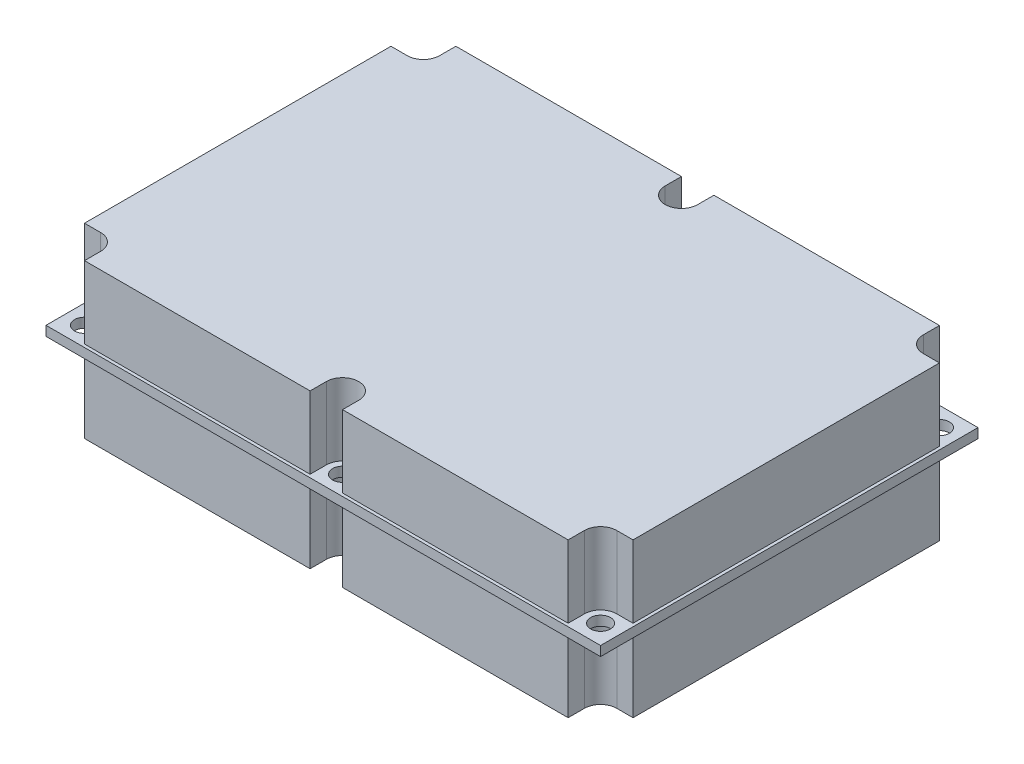
ISO-10303-21;
HEADER;
FILE_DESCRIPTION(('STEP AP214'),'2;1');
FILE_NAME('part.step','',(''),(''),'','','');
FILE_SCHEMA(('AUTOMOTIVE_DESIGN { 1 0 10303 214 1 1 1 1 }'));
ENDSEC;
DATA;
#1=APPLICATION_CONTEXT('core data for automotive mechanical design processes');
#2=APPLICATION_PROTOCOL_DEFINITION('international standard','automotive_design',2000,#1);
#3=PRODUCT_CONTEXT('',#1,'mechanical');
#4=PRODUCT('Part','Part','',(#3));
#5=PRODUCT_RELATED_PRODUCT_CATEGORY('part','',(#4));
#6=PRODUCT_DEFINITION_FORMATION('','',#4);
#7=PRODUCT_DEFINITION_CONTEXT('part definition',#1,'design');
#8=PRODUCT_DEFINITION('design','',#6,#7);
#9=PRODUCT_DEFINITION_SHAPE('','',#8);
#10=(LENGTH_UNIT() NAMED_UNIT(*) SI_UNIT(.MILLI.,.METRE.));
#11=(NAMED_UNIT(*) PLANE_ANGLE_UNIT() SI_UNIT($,.RADIAN.));
#12=(NAMED_UNIT(*) SI_UNIT($,.STERADIAN.) SOLID_ANGLE_UNIT());
#13=UNCERTAINTY_MEASURE_WITH_UNIT(LENGTH_MEASURE(1.E-05),#10,'distance_accuracy_value','');
#14=(GEOMETRIC_REPRESENTATION_CONTEXT(3) GLOBAL_UNCERTAINTY_ASSIGNED_CONTEXT((#13)) GLOBAL_UNIT_ASSIGNED_CONTEXT((#10,
#11,#12)) REPRESENTATION_CONTEXT('',''));
#15=CARTESIAN_POINT('',(0.,0.,0.));
#16=DIRECTION('',(0.,0.,1.));
#17=DIRECTION('',(1.,0.,0.));
#18=AXIS2_PLACEMENT_3D('',#15,#16,#17);
#19=CARTESIAN_POINT('',(-42.545,12.7,-27.94));
#20=DIRECTION('',(0.,-1.,0.));
#21=DIRECTION('',(0.,0.,-1.));
#22=AXIS2_PLACEMENT_3D('',#19,#20,#21);
#23=CYLINDRICAL_SURFACE('',#22,2.67499999999999);
#24=CARTESIAN_POINT('',(-42.545,-12.7,-27.94));
#25=DIRECTION('',(0.,-1.,0.));
#26=DIRECTION('',(0.,0.,1.));
#27=AXIS2_PLACEMENT_3D('',#24,#25,#26);
#28=CIRCLE('',#27,2.67499999999999);
#29=CARTESIAN_POINT('',(-39.87,-12.7,-27.94));
#30=VERTEX_POINT('',#29);
#31=CARTESIAN_POINT('',(-42.545,-12.7,-25.265));
#32=VERTEX_POINT('',#31);
#33=EDGE_CURVE('E266',#30,#32,#28,.T.);
#34=ORIENTED_EDGE('',*,*,#33,.T.);
#35=DIRECTION('',(0.,-1.,0.));
#36=VECTOR('',#35,1.);
#37=CARTESIAN_POINT('',(-42.545,12.7,-25.265));
#38=LINE('',#37,#36);
#39=CARTESIAN_POINT('',(-42.545,12.7,-25.265));
#40=VERTEX_POINT('',#39);
#41=EDGE_CURVE('E12',#40,#32,#38,.T.);
#42=ORIENTED_EDGE('',*,*,#41,.F.);
#43=CARTESIAN_POINT('',(-42.545,12.7,-27.94));
#44=DIRECTION('',(0.,-1.,0.));
#45=DIRECTION('',(0.,0.,1.));
#46=AXIS2_PLACEMENT_3D('',#43,#44,#45);
#47=CIRCLE('',#46,2.67499999999999);
#48=CARTESIAN_POINT('',(-39.87,12.7,-27.94));
#49=VERTEX_POINT('',#48);
#50=EDGE_CURVE('E324',#49,#40,#47,.T.);
#51=ORIENTED_EDGE('',*,*,#50,.F.);
#52=DIRECTION('',(0.,-1.,0.));
#53=VECTOR('',#52,1.);
#54=CARTESIAN_POINT('',(-39.87,12.7,-27.94));
#55=LINE('',#54,#53);
#56=EDGE_CURVE('E262',#49,#30,#55,.T.);
#57=ORIENTED_EDGE('',*,*,#56,.T.);
#58=EDGE_LOOP('',(#34,#42,#51,#57));
#59=FACE_BOUND('',#58,.T.);
#60=ADVANCED_FACE('F52',(#59),#23,.F.);
#61=CARTESIAN_POINT('',(-42.545,12.7,-25.265));
#62=DIRECTION('',(0.,0.,1.));
#63=DIRECTION('',(1.,0.,0.));
#64=AXIS2_PLACEMENT_3D('',#61,#62,#63);
#65=PLANE('',#64);
#66=DIRECTION('',(-1.,0.,0.));
#67=VECTOR('',#66,1.);
#68=CARTESIAN_POINT('',(-42.545,-12.7,-25.265));
#69=LINE('',#68,#67);
#70=CARTESIAN_POINT('',(-45.22,-12.7,-25.265));
#71=VERTEX_POINT('',#70);
#72=EDGE_CURVE('E270',#32,#71,#69,.T.);
#73=ORIENTED_EDGE('',*,*,#72,.T.);
#74=DIRECTION('',(0.,-1.,0.));
#75=VECTOR('',#74,1.);
#76=CARTESIAN_POINT('',(-45.22,12.7,-25.265));
#77=LINE('',#76,#75);
#78=CARTESIAN_POINT('',(-45.22,12.7,-25.265));
#79=VERTEX_POINT('',#78);
#80=EDGE_CURVE('E61',#79,#71,#77,.T.);
#81=ORIENTED_EDGE('',*,*,#80,.F.);
#82=DIRECTION('',(-1.,0.,0.));
#83=VECTOR('',#82,1.);
#84=CARTESIAN_POINT('',(-42.545,12.7,-25.265));
#85=LINE('',#84,#83);
#86=EDGE_CURVE('E173',#40,#79,#85,.T.);
#87=ORIENTED_EDGE('',*,*,#86,.F.);
#88=ORIENTED_EDGE('',*,*,#41,.T.);
#89=EDGE_LOOP('',(#73,#81,#87,#88));
#90=FACE_BOUND('',#89,.T.);
#91=ADVANCED_FACE('F484',(#90),#65,.F.);
#92=CARTESIAN_POINT('',(-45.22,12.7,-25.265));
#93=DIRECTION('',(1.,0.,0.));
#94=DIRECTION('',(0.,0.,-1.));
#95=AXIS2_PLACEMENT_3D('',#92,#93,#94);
#96=PLANE('',#95);
#97=DIRECTION('',(0.,0.,1.));
#98=VECTOR('',#97,1.);
#99=CARTESIAN_POINT('',(-45.22,-12.7,-25.265));
#100=LINE('',#99,#98);
#101=CARTESIAN_POINT('',(-45.22,-12.7,25.265));
#102=VERTEX_POINT('',#101);
#103=EDGE_CURVE('E273',#71,#102,#100,.T.);
#104=ORIENTED_EDGE('',*,*,#103,.T.);
#105=DIRECTION('',(0.,-1.,0.));
#106=VECTOR('',#105,1.);
#107=CARTESIAN_POINT('',(-45.22,12.7,25.265));
#108=LINE('',#107,#106);
#109=CARTESIAN_POINT('',(-45.22,12.7,25.265));
#110=VERTEX_POINT('',#109);
#111=EDGE_CURVE('E394',#110,#102,#108,.T.);
#112=ORIENTED_EDGE('',*,*,#111,.F.);
#113=DIRECTION('',(0.,0.,1.));
#114=VECTOR('',#113,1.);
#115=CARTESIAN_POINT('',(-45.22,12.7,-25.265));
#116=LINE('',#115,#114);
#117=EDGE_CURVE('E404',#79,#110,#116,.T.);
#118=ORIENTED_EDGE('',*,*,#117,.F.);
#119=ORIENTED_EDGE('',*,*,#80,.T.);
#120=EDGE_LOOP('',(#104,#112,#118,#119));
#121=FACE_BOUND('',#120,.T.);
#122=ADVANCED_FACE('F402',(#121),#96,.F.);
#123=CARTESIAN_POINT('',(-42.545,12.7,25.265));
#124=DIRECTION('',(0.,0.,-1.));
#125=DIRECTION('',(-1.,0.,0.));
#126=AXIS2_PLACEMENT_3D('',#123,#124,#125);
#127=PLANE('',#126);
#128=DIRECTION('',(1.,0.,0.));
#129=VECTOR('',#128,1.);
#130=CARTESIAN_POINT('',(-42.545,-12.7,25.265));
#131=LINE('',#130,#129);
#132=CARTESIAN_POINT('',(-42.545,-12.7,25.265));
#133=VERTEX_POINT('',#132);
#134=EDGE_CURVE('E276',#102,#133,#131,.T.);
#135=ORIENTED_EDGE('',*,*,#134,.T.);
#136=DIRECTION('',(0.,-1.,0.));
#137=VECTOR('',#136,1.);
#138=CARTESIAN_POINT('',(-42.545,12.7,25.265));
#139=LINE('',#138,#137);
#140=CARTESIAN_POINT('',(-42.545,12.7,25.265));
#141=VERTEX_POINT('',#140);
#142=EDGE_CURVE('E390',#141,#133,#139,.T.);
#143=ORIENTED_EDGE('',*,*,#142,.F.);
#144=DIRECTION('',(1.,0.,0.));
#145=VECTOR('',#144,1.);
#146=CARTESIAN_POINT('',(-42.545,12.7,25.265));
#147=LINE('',#146,#145);
#148=EDGE_CURVE('E422',#110,#141,#147,.T.);
#149=ORIENTED_EDGE('',*,*,#148,.F.);
#150=ORIENTED_EDGE('',*,*,#111,.T.);
#151=EDGE_LOOP('',(#135,#143,#149,#150));
#152=FACE_BOUND('',#151,.T.);
#153=ADVANCED_FACE('F413',(#152),#127,.F.);
#154=CARTESIAN_POINT('',(-42.545,12.7,27.94));
#155=DIRECTION('',(0.,-1.,0.));
#156=DIRECTION('',(0.,0.,-1.));
#157=AXIS2_PLACEMENT_3D('',#154,#155,#156);
#158=CYLINDRICAL_SURFACE('',#157,2.67500000000001);
#159=CARTESIAN_POINT('',(-42.545,-12.7,27.94));
#160=DIRECTION('',(0.,-1.,0.));
#161=DIRECTION('',(0.,0.,1.));
#162=AXIS2_PLACEMENT_3D('',#159,#160,#161);
#163=CIRCLE('',#162,2.67500000000001);
#164=CARTESIAN_POINT('',(-39.87,-12.7,27.94));
#165=VERTEX_POINT('',#164);
#166=EDGE_CURVE('E278',#133,#165,#163,.T.);
#167=ORIENTED_EDGE('',*,*,#166,.T.);
#168=DIRECTION('',(0.,-1.,0.));
#169=VECTOR('',#168,1.);
#170=CARTESIAN_POINT('',(-39.87,12.7,27.94));
#171=LINE('',#170,#169);
#172=CARTESIAN_POINT('',(-39.87,12.7,27.94));
#173=VERTEX_POINT('',#172);
#174=EDGE_CURVE('E387',#173,#165,#171,.T.);
#175=ORIENTED_EDGE('',*,*,#174,.F.);
#176=CARTESIAN_POINT('',(-42.545,12.7,27.94));
#177=DIRECTION('',(0.,-1.,0.));
#178=DIRECTION('',(0.,0.,1.));
#179=AXIS2_PLACEMENT_3D('',#176,#177,#178);
#180=CIRCLE('',#179,2.67500000000001);
#181=EDGE_CURVE('E419',#141,#173,#180,.T.);
#182=ORIENTED_EDGE('',*,*,#181,.F.);
#183=ORIENTED_EDGE('',*,*,#142,.T.);
#184=EDGE_LOOP('',(#167,#175,#182,#183));
#185=FACE_BOUND('',#184,.T.);
#186=ADVANCED_FACE('F417',(#185),#158,.F.);
#187=CARTESIAN_POINT('',(-39.87,12.7,27.94));
#188=DIRECTION('',(1.,0.,0.));
#189=DIRECTION('',(0.,0.,-1.));
#190=AXIS2_PLACEMENT_3D('',#187,#188,#189);
#191=PLANE('',#190);
#192=DIRECTION('',(0.,0.,1.));
#193=VECTOR('',#192,1.);
#194=CARTESIAN_POINT('',(-39.87,-12.7,27.94));
#195=LINE('',#194,#193);
#196=CARTESIAN_POINT('',(-39.87,-12.7,30.615));
#197=VERTEX_POINT('',#196);
#198=EDGE_CURVE('E280',#165,#197,#195,.T.);
#199=ORIENTED_EDGE('',*,*,#198,.T.);
#200=DIRECTION('',(0.,-1.,0.));
#201=VECTOR('',#200,1.);
#202=CARTESIAN_POINT('',(-39.87,12.7,30.615));
#203=LINE('',#202,#201);
#204=CARTESIAN_POINT('',(-39.87,12.7,30.615));
#205=VERTEX_POINT('',#204);
#206=EDGE_CURVE('E383',#205,#197,#203,.T.);
#207=ORIENTED_EDGE('',*,*,#206,.F.);
#208=DIRECTION('',(0.,0.,1.));
#209=VECTOR('',#208,1.);
#210=CARTESIAN_POINT('',(-39.87,12.7,27.94));
#211=LINE('',#210,#209);
#212=EDGE_CURVE('E421',#173,#205,#211,.T.);
#213=ORIENTED_EDGE('',*,*,#212,.F.);
#214=ORIENTED_EDGE('',*,*,#174,.T.);
#215=EDGE_LOOP('',(#199,#207,#213,#214));
#216=FACE_BOUND('',#215,.T.);
#217=ADVANCED_FACE('F497',(#216),#191,.F.);
#218=CARTESIAN_POINT('',(-39.87,12.7,30.615));
#219=DIRECTION('',(0.,0.,-1.));
#220=DIRECTION('',(-1.,0.,0.));
#221=AXIS2_PLACEMENT_3D('',#218,#219,#220);
#222=PLANE('',#221);
#223=DIRECTION('',(1.,0.,0.));
#224=VECTOR('',#223,1.);
#225=CARTESIAN_POINT('',(-39.87,-12.7,30.615));
#226=LINE('',#225,#224);
#227=CARTESIAN_POINT('',(-2.675,-12.7,30.615));
#228=VERTEX_POINT('',#227);
#229=EDGE_CURVE('E282',#197,#228,#226,.T.);
#230=ORIENTED_EDGE('',*,*,#229,.T.);
#231=DIRECTION('',(0.,-1.,0.));
#232=VECTOR('',#231,1.);
#233=CARTESIAN_POINT('',(-2.675,12.7,30.615));
#234=LINE('',#233,#232);
#235=CARTESIAN_POINT('',(-2.675,12.7,30.615));
#236=VERTEX_POINT('',#235);
#237=EDGE_CURVE('E379',#236,#228,#234,.T.);
#238=ORIENTED_EDGE('',*,*,#237,.F.);
#239=DIRECTION('',(1.,0.,0.));
#240=VECTOR('',#239,1.);
#241=CARTESIAN_POINT('',(-39.87,12.7,30.615));
#242=LINE('',#241,#240);
#243=EDGE_CURVE('E424',#205,#236,#242,.T.);
#244=ORIENTED_EDGE('',*,*,#243,.F.);
#245=ORIENTED_EDGE('',*,*,#206,.T.);
#246=EDGE_LOOP('',(#230,#238,#244,#245));
#247=FACE_BOUND('',#246,.T.);
#248=ADVANCED_FACE('F500',(#247),#222,.F.);
#249=CARTESIAN_POINT('',(-2.67499999999998,12.7,27.94));
#250=DIRECTION('',(-1.,0.,0.));
#251=DIRECTION('',(0.,0.,1.));
#252=AXIS2_PLACEMENT_3D('',#249,#250,#251);
#253=PLANE('',#252);
#254=DIRECTION('',(0.,0.,-1.));
#255=VECTOR('',#254,1.);
#256=CARTESIAN_POINT('',(-2.67499999999998,-12.7,27.94));
#257=LINE('',#256,#255);
#258=CARTESIAN_POINT('',(-2.67499999999998,-12.7,27.94));
#259=VERTEX_POINT('',#258);
#260=EDGE_CURVE('E285',#228,#259,#257,.T.);
#261=ORIENTED_EDGE('',*,*,#260,.T.);
#262=DIRECTION('',(0.,-1.,0.));
#263=VECTOR('',#262,1.);
#264=CARTESIAN_POINT('',(-2.67499999999998,12.7,27.94));
#265=LINE('',#264,#263);
#266=CARTESIAN_POINT('',(-2.67499999999998,12.7,27.94));
#267=VERTEX_POINT('',#266);
#268=EDGE_CURVE('E375',#267,#259,#265,.T.);
#269=ORIENTED_EDGE('',*,*,#268,.F.);
#270=DIRECTION('',(0.,0.,-1.));
#271=VECTOR('',#270,1.);
#272=CARTESIAN_POINT('',(-2.67499999999998,12.7,27.94));
#273=LINE('',#272,#271);
#274=EDGE_CURVE('E430',#236,#267,#273,.T.);
#275=ORIENTED_EDGE('',*,*,#274,.F.);
#276=ORIENTED_EDGE('',*,*,#237,.T.);
#277=EDGE_LOOP('',(#261,#269,#275,#276));
#278=FACE_BOUND('',#277,.T.);
#279=ADVANCED_FACE('F504',(#278),#253,.F.);
#280=CARTESIAN_POINT('',(0.,12.7,27.94));
#281=DIRECTION('',(0.,-1.,0.));
#282=DIRECTION('',(0.,0.,-1.));
#283=AXIS2_PLACEMENT_3D('',#280,#281,#282);
#284=CYLINDRICAL_SURFACE('',#283,2.67499999999999);
#285=CARTESIAN_POINT('',(0.,-12.7,27.94));
#286=DIRECTION('',(0.,-1.,0.));
#287=DIRECTION('',(0.,0.,1.));
#288=AXIS2_PLACEMENT_3D('',#285,#286,#287);
#289=CIRCLE('',#288,2.67499999999999);
#290=CARTESIAN_POINT('',(2.675,-12.7,27.94));
#291=VERTEX_POINT('',#290);
#292=EDGE_CURVE('E287',#259,#291,#289,.T.);
#293=ORIENTED_EDGE('',*,*,#292,.T.);
#294=DIRECTION('',(0.,-1.,0.));
#295=VECTOR('',#294,1.);
#296=CARTESIAN_POINT('',(2.675,12.7,27.94));
#297=LINE('',#296,#295);
#298=CARTESIAN_POINT('',(2.675,12.7,27.94));
#299=VERTEX_POINT('',#298);
#300=EDGE_CURVE('E372',#299,#291,#297,.T.);
#301=ORIENTED_EDGE('',*,*,#300,.F.);
#302=CARTESIAN_POINT('',(0.,12.7,27.94));
#303=DIRECTION('',(0.,-1.,0.));
#304=DIRECTION('',(0.,0.,1.));
#305=AXIS2_PLACEMENT_3D('',#302,#303,#304);
#306=CIRCLE('',#305,2.67499999999999);
#307=EDGE_CURVE('E432',#267,#299,#306,.T.);
#308=ORIENTED_EDGE('',*,*,#307,.F.);
#309=ORIENTED_EDGE('',*,*,#268,.T.);
#310=EDGE_LOOP('',(#293,#301,#308,#309));
#311=FACE_BOUND('',#310,.T.);
#312=ADVANCED_FACE('F508',(#311),#284,.F.);
#313=CARTESIAN_POINT('',(2.675,12.7,27.94));
#314=DIRECTION('',(1.,0.,0.));
#315=DIRECTION('',(0.,0.,-1.));
#316=AXIS2_PLACEMENT_3D('',#313,#314,#315);
#317=PLANE('',#316);
#318=DIRECTION('',(0.,0.,1.));
#319=VECTOR('',#318,1.);
#320=CARTESIAN_POINT('',(2.675,-12.7,27.94));
#321=LINE('',#320,#319);
#322=CARTESIAN_POINT('',(2.675,-12.7,30.615));
#323=VERTEX_POINT('',#322);
#324=EDGE_CURVE('E290',#291,#323,#321,.T.);
#325=ORIENTED_EDGE('',*,*,#324,.T.);
#326=DIRECTION('',(0.,-1.,0.));
#327=VECTOR('',#326,1.);
#328=CARTESIAN_POINT('',(2.675,12.7,30.615));
#329=LINE('',#328,#327);
#330=CARTESIAN_POINT('',(2.675,12.7,30.615));
#331=VERTEX_POINT('',#330);
#332=EDGE_CURVE('E368',#331,#323,#329,.T.);
#333=ORIENTED_EDGE('',*,*,#332,.F.);
#334=DIRECTION('',(0.,0.,1.));
#335=VECTOR('',#334,1.);
#336=CARTESIAN_POINT('',(2.675,12.7,27.94));
#337=LINE('',#336,#335);
#338=EDGE_CURVE('E434',#299,#331,#337,.T.);
#339=ORIENTED_EDGE('',*,*,#338,.F.);
#340=ORIENTED_EDGE('',*,*,#300,.T.);
#341=EDGE_LOOP('',(#325,#333,#339,#340));
#342=FACE_BOUND('',#341,.T.);
#343=ADVANCED_FACE('F512',(#342),#317,.F.);
#344=CARTESIAN_POINT('',(2.675,12.7,30.615));
#345=DIRECTION('',(0.,0.,-1.));
#346=DIRECTION('',(-1.,0.,0.));
#347=AXIS2_PLACEMENT_3D('',#344,#345,#346);
#348=PLANE('',#347);
#349=DIRECTION('',(1.,0.,0.));
#350=VECTOR('',#349,1.);
#351=CARTESIAN_POINT('',(2.675,-12.7,30.615));
#352=LINE('',#351,#350);
#353=CARTESIAN_POINT('',(39.87,-12.7,30.615));
#354=VERTEX_POINT('',#353);
#355=EDGE_CURVE('E292',#323,#354,#352,.T.);
#356=ORIENTED_EDGE('',*,*,#355,.T.);
#357=DIRECTION('',(0.,-1.,0.));
#358=VECTOR('',#357,1.);
#359=CARTESIAN_POINT('',(39.87,12.7,30.615));
#360=LINE('',#359,#358);
#361=CARTESIAN_POINT('',(39.87,12.7,30.615));
#362=VERTEX_POINT('',#361);
#363=EDGE_CURVE('E364',#362,#354,#360,.T.);
#364=ORIENTED_EDGE('',*,*,#363,.F.);
#365=DIRECTION('',(1.,0.,0.));
#366=VECTOR('',#365,1.);
#367=CARTESIAN_POINT('',(2.675,12.7,30.615));
#368=LINE('',#367,#366);
#369=EDGE_CURVE('E436',#331,#362,#368,.T.);
#370=ORIENTED_EDGE('',*,*,#369,.F.);
#371=ORIENTED_EDGE('',*,*,#332,.T.);
#372=EDGE_LOOP('',(#356,#364,#370,#371));
#373=FACE_BOUND('',#372,.T.);
#374=ADVANCED_FACE('F516',(#373),#348,.F.);
#375=CARTESIAN_POINT('',(39.87,12.7,27.94));
#376=DIRECTION('',(-1.,0.,0.));
#377=DIRECTION('',(0.,0.,1.));
#378=AXIS2_PLACEMENT_3D('',#375,#376,#377);
#379=PLANE('',#378);
#380=DIRECTION('',(0.,0.,-1.));
#381=VECTOR('',#380,1.);
#382=CARTESIAN_POINT('',(39.87,-12.7,27.94));
#383=LINE('',#382,#381);
#384=CARTESIAN_POINT('',(39.87,-12.7,27.94));
#385=VERTEX_POINT('',#384);
#386=EDGE_CURVE('E294',#354,#385,#383,.T.);
#387=ORIENTED_EDGE('',*,*,#386,.T.);
#388=DIRECTION('',(0.,-1.,0.));
#389=VECTOR('',#388,1.);
#390=CARTESIAN_POINT('',(39.87,12.7,27.94));
#391=LINE('',#390,#389);
#392=CARTESIAN_POINT('',(39.87,12.7,27.94));
#393=VERTEX_POINT('',#392);
#394=EDGE_CURVE('E360',#393,#385,#391,.T.);
#395=ORIENTED_EDGE('',*,*,#394,.F.);
#396=DIRECTION('',(0.,0.,-1.));
#397=VECTOR('',#396,1.);
#398=CARTESIAN_POINT('',(39.87,12.7,27.94));
#399=LINE('',#398,#397);
#400=EDGE_CURVE('E439',#362,#393,#399,.T.);
#401=ORIENTED_EDGE('',*,*,#400,.F.);
#402=ORIENTED_EDGE('',*,*,#363,.T.);
#403=EDGE_LOOP('',(#387,#395,#401,#402));
#404=FACE_BOUND('',#403,.T.);
#405=ADVANCED_FACE('F520',(#404),#379,.F.);
#406=CARTESIAN_POINT('',(42.545,12.7,27.94));
#407=DIRECTION('',(0.,-1.,0.));
#408=DIRECTION('',(0.,0.,-1.));
#409=AXIS2_PLACEMENT_3D('',#406,#407,#408);
#410=CYLINDRICAL_SURFACE('',#409,2.67499999999998);
#411=CARTESIAN_POINT('',(42.545,-12.7,27.94));
#412=DIRECTION('',(0.,-1.,0.));
#413=DIRECTION('',(0.,0.,1.));
#414=AXIS2_PLACEMENT_3D('',#411,#412,#413);
#415=CIRCLE('',#414,2.67499999999998);
#416=CARTESIAN_POINT('',(42.545,-12.7,25.265));
#417=VERTEX_POINT('',#416);
#418=EDGE_CURVE('E296',#385,#417,#415,.T.);
#419=ORIENTED_EDGE('',*,*,#418,.T.);
#420=DIRECTION('',(0.,-1.,0.));
#421=VECTOR('',#420,1.);
#422=CARTESIAN_POINT('',(42.545,12.7,25.265));
#423=LINE('',#422,#421);
#424=CARTESIAN_POINT('',(42.545,12.7,25.265));
#425=VERTEX_POINT('',#424);
#426=EDGE_CURVE('E356',#425,#417,#423,.T.);
#427=ORIENTED_EDGE('',*,*,#426,.F.);
#428=CARTESIAN_POINT('',(42.545,12.7,27.94));
#429=DIRECTION('',(0.,-1.,0.));
#430=DIRECTION('',(0.,0.,1.));
#431=AXIS2_PLACEMENT_3D('',#428,#429,#430);
#432=CIRCLE('',#431,2.67499999999998);
#433=EDGE_CURVE('E442',#393,#425,#432,.T.);
#434=ORIENTED_EDGE('',*,*,#433,.F.);
#435=ORIENTED_EDGE('',*,*,#394,.T.);
#436=EDGE_LOOP('',(#419,#427,#434,#435));
#437=FACE_BOUND('',#436,.T.);
#438=ADVANCED_FACE('F524',(#437),#410,.F.);
#439=CARTESIAN_POINT('',(42.545,12.7,25.265));
#440=DIRECTION('',(0.,0.,-1.));
#441=DIRECTION('',(-1.,0.,0.));
#442=AXIS2_PLACEMENT_3D('',#439,#440,#441);
#443=PLANE('',#442);
#444=DIRECTION('',(1.,0.,0.));
#445=VECTOR('',#444,1.);
#446=CARTESIAN_POINT('',(42.545,-12.7,25.265));
#447=LINE('',#446,#445);
#448=CARTESIAN_POINT('',(45.22,-12.7,25.265));
#449=VERTEX_POINT('',#448);
#450=EDGE_CURVE('E298',#417,#449,#447,.T.);
#451=ORIENTED_EDGE('',*,*,#450,.T.);
#452=DIRECTION('',(0.,-1.,0.));
#453=VECTOR('',#452,1.);
#454=CARTESIAN_POINT('',(45.22,12.7,25.265));
#455=LINE('',#454,#453);
#456=CARTESIAN_POINT('',(45.22,12.7,25.265));
#457=VERTEX_POINT('',#456);
#458=EDGE_CURVE('E352',#457,#449,#455,.T.);
#459=ORIENTED_EDGE('',*,*,#458,.F.);
#460=DIRECTION('',(1.,0.,0.));
#461=VECTOR('',#460,1.);
#462=CARTESIAN_POINT('',(42.545,12.7,25.265));
#463=LINE('',#462,#461);
#464=EDGE_CURVE('E445',#425,#457,#463,.T.);
#465=ORIENTED_EDGE('',*,*,#464,.F.);
#466=ORIENTED_EDGE('',*,*,#426,.T.);
#467=EDGE_LOOP('',(#451,#459,#465,#466));
#468=FACE_BOUND('',#467,.T.);
#469=ADVANCED_FACE('F528',(#468),#443,.F.);
#470=CARTESIAN_POINT('',(45.22,12.7,25.265));
#471=DIRECTION('',(-1.,0.,0.));
#472=DIRECTION('',(0.,0.,1.));
#473=AXIS2_PLACEMENT_3D('',#470,#471,#472);
#474=PLANE('',#473);
#475=DIRECTION('',(0.,0.,-1.));
#476=VECTOR('',#475,1.);
#477=CARTESIAN_POINT('',(45.22,-12.7,25.265));
#478=LINE('',#477,#476);
#479=CARTESIAN_POINT('',(45.22,-12.7,-25.265));
#480=VERTEX_POINT('',#479);
#481=EDGE_CURVE('E300',#449,#480,#478,.T.);
#482=ORIENTED_EDGE('',*,*,#481,.T.);
#483=DIRECTION('',(0.,-1.,0.));
#484=VECTOR('',#483,1.);
#485=CARTESIAN_POINT('',(45.22,12.7,-25.265));
#486=LINE('',#485,#484);
#487=CARTESIAN_POINT('',(45.22,12.7,-25.265));
#488=VERTEX_POINT('',#487);
#489=EDGE_CURVE('E348',#488,#480,#486,.T.);
#490=ORIENTED_EDGE('',*,*,#489,.F.);
#491=DIRECTION('',(0.,0.,-1.));
#492=VECTOR('',#491,1.);
#493=CARTESIAN_POINT('',(45.22,12.7,25.265));
#494=LINE('',#493,#492);
#495=EDGE_CURVE('E448',#457,#488,#494,.T.);
#496=ORIENTED_EDGE('',*,*,#495,.F.);
#497=ORIENTED_EDGE('',*,*,#458,.T.);
#498=EDGE_LOOP('',(#482,#490,#496,#497));
#499=FACE_BOUND('',#498,.T.);
#500=ADVANCED_FACE('F532',(#499),#474,.F.);
#501=CARTESIAN_POINT('',(42.545,12.7,-25.265));
#502=DIRECTION('',(0.,0.,1.));
#503=DIRECTION('',(1.,0.,0.));
#504=AXIS2_PLACEMENT_3D('',#501,#502,#503);
#505=PLANE('',#504);
#506=DIRECTION('',(-1.,0.,0.));
#507=VECTOR('',#506,1.);
#508=CARTESIAN_POINT('',(42.545,-12.7,-25.265));
#509=LINE('',#508,#507);
#510=CARTESIAN_POINT('',(42.545,-12.7,-25.265));
#511=VERTEX_POINT('',#510);
#512=EDGE_CURVE('E303',#480,#511,#509,.T.);
#513=ORIENTED_EDGE('',*,*,#512,.T.);
#514=DIRECTION('',(0.,-1.,0.));
#515=VECTOR('',#514,1.);
#516=CARTESIAN_POINT('',(42.545,12.7,-25.265));
#517=LINE('',#516,#515);
#518=CARTESIAN_POINT('',(42.545,12.7,-25.265));
#519=VERTEX_POINT('',#518);
#520=EDGE_CURVE('E344',#519,#511,#517,.T.);
#521=ORIENTED_EDGE('',*,*,#520,.F.);
#522=DIRECTION('',(-1.,0.,0.));
#523=VECTOR('',#522,1.);
#524=CARTESIAN_POINT('',(42.545,12.7,-25.265));
#525=LINE('',#524,#523);
#526=EDGE_CURVE('E451',#488,#519,#525,.T.);
#527=ORIENTED_EDGE('',*,*,#526,.F.);
#528=ORIENTED_EDGE('',*,*,#489,.T.);
#529=EDGE_LOOP('',(#513,#521,#527,#528));
#530=FACE_BOUND('',#529,.T.);
#531=ADVANCED_FACE('F536',(#530),#505,.F.);
#532=CARTESIAN_POINT('',(42.545,12.7,-27.94));
#533=DIRECTION('',(0.,-1.,0.));
#534=DIRECTION('',(0.,0.,-1.));
#535=AXIS2_PLACEMENT_3D('',#532,#533,#534);
#536=CYLINDRICAL_SURFACE('',#535,2.675);
#537=CARTESIAN_POINT('',(42.545,-12.7,-27.94));
#538=DIRECTION('',(0.,-1.,0.));
#539=DIRECTION('',(0.,0.,1.));
#540=AXIS2_PLACEMENT_3D('',#537,#538,#539);
#541=CIRCLE('',#540,2.675);
#542=CARTESIAN_POINT('',(39.87,-12.7,-27.94));
#543=VERTEX_POINT('',#542);
#544=EDGE_CURVE('E306',#511,#543,#541,.T.);
#545=ORIENTED_EDGE('',*,*,#544,.T.);
#546=DIRECTION('',(0.,-1.,0.));
#547=VECTOR('',#546,1.);
#548=CARTESIAN_POINT('',(39.87,12.7,-27.94));
#549=LINE('',#548,#547);
#550=CARTESIAN_POINT('',(39.87,12.7,-27.94));
#551=VERTEX_POINT('',#550);
#552=EDGE_CURVE('E340',#551,#543,#549,.T.);
#553=ORIENTED_EDGE('',*,*,#552,.F.);
#554=CARTESIAN_POINT('',(42.545,12.7,-27.94));
#555=DIRECTION('',(0.,-1.,0.));
#556=DIRECTION('',(0.,0.,1.));
#557=AXIS2_PLACEMENT_3D('',#554,#555,#556);
#558=CIRCLE('',#557,2.675);
#559=EDGE_CURVE('E453',#519,#551,#558,.T.);
#560=ORIENTED_EDGE('',*,*,#559,.F.);
#561=ORIENTED_EDGE('',*,*,#520,.T.);
#562=EDGE_LOOP('',(#545,#553,#560,#561));
#563=FACE_BOUND('',#562,.T.);
#564=ADVANCED_FACE('F540',(#563),#536,.F.);
#565=CARTESIAN_POINT('',(39.87,12.7,-27.94));
#566=DIRECTION('',(-1.,0.,0.));
#567=DIRECTION('',(0.,0.,1.));
#568=AXIS2_PLACEMENT_3D('',#565,#566,#567);
#569=PLANE('',#568);
#570=DIRECTION('',(0.,0.,-1.));
#571=VECTOR('',#570,1.);
#572=CARTESIAN_POINT('',(39.87,-12.7,-27.94));
#573=LINE('',#572,#571);
#574=CARTESIAN_POINT('',(39.87,-12.7,-30.615));
#575=VERTEX_POINT('',#574);
#576=EDGE_CURVE('E309',#543,#575,#573,.T.);
#577=ORIENTED_EDGE('',*,*,#576,.T.);
#578=DIRECTION('',(0.,-1.,0.));
#579=VECTOR('',#578,1.);
#580=CARTESIAN_POINT('',(39.87,12.7,-30.615));
#581=LINE('',#580,#579);
#582=CARTESIAN_POINT('',(39.87,12.7,-30.615));
#583=VERTEX_POINT('',#582);
#584=EDGE_CURVE('E336',#583,#575,#581,.T.);
#585=ORIENTED_EDGE('',*,*,#584,.F.);
#586=DIRECTION('',(0.,0.,-1.));
#587=VECTOR('',#586,1.);
#588=CARTESIAN_POINT('',(39.87,12.7,-27.94));
#589=LINE('',#588,#587);
#590=EDGE_CURVE('E455',#551,#583,#589,.T.);
#591=ORIENTED_EDGE('',*,*,#590,.F.);
#592=ORIENTED_EDGE('',*,*,#552,.T.);
#593=EDGE_LOOP('',(#577,#585,#591,#592));
#594=FACE_BOUND('',#593,.T.);
#595=ADVANCED_FACE('F544',(#594),#569,.F.);
#596=CARTESIAN_POINT('',(39.87,12.7,-30.615));
#597=DIRECTION('',(0.,0.,1.));
#598=DIRECTION('',(1.,0.,0.));
#599=AXIS2_PLACEMENT_3D('',#596,#597,#598);
#600=PLANE('',#599);
#601=DIRECTION('',(-1.,0.,0.));
#602=VECTOR('',#601,1.);
#603=CARTESIAN_POINT('',(39.87,-12.7,-30.615));
#604=LINE('',#603,#602);
#605=CARTESIAN_POINT('',(2.675,-12.7,-30.615));
#606=VERTEX_POINT('',#605);
#607=EDGE_CURVE('E312',#575,#606,#604,.T.);
#608=ORIENTED_EDGE('',*,*,#607,.T.);
#609=DIRECTION('',(0.,-1.,0.));
#610=VECTOR('',#609,1.);
#611=CARTESIAN_POINT('',(2.675,12.7,-30.615));
#612=LINE('',#611,#610);
#613=CARTESIAN_POINT('',(2.675,12.7,-30.615));
#614=VERTEX_POINT('',#613);
#615=EDGE_CURVE('E333',#614,#606,#612,.T.);
#616=ORIENTED_EDGE('',*,*,#615,.F.);
#617=DIRECTION('',(-1.,0.,0.));
#618=VECTOR('',#617,1.);
#619=CARTESIAN_POINT('',(39.87,12.7,-30.615));
#620=LINE('',#619,#618);
#621=EDGE_CURVE('E457',#583,#614,#620,.T.);
#622=ORIENTED_EDGE('',*,*,#621,.F.);
#623=ORIENTED_EDGE('',*,*,#584,.T.);
#624=EDGE_LOOP('',(#608,#616,#622,#623));
#625=FACE_BOUND('',#624,.T.);
#626=ADVANCED_FACE('F548',(#625),#600,.F.);
#627=CARTESIAN_POINT('',(2.675,12.7,-27.94));
#628=DIRECTION('',(1.,0.,0.));
#629=DIRECTION('',(0.,0.,-1.));
#630=AXIS2_PLACEMENT_3D('',#627,#628,#629);
#631=PLANE('',#630);
#632=DIRECTION('',(0.,0.,1.));
#633=VECTOR('',#632,1.);
#634=CARTESIAN_POINT('',(2.675,-12.7,-27.94));
#635=LINE('',#634,#633);
#636=CARTESIAN_POINT('',(2.675,-12.7,-27.94));
#637=VERTEX_POINT('',#636);
#638=EDGE_CURVE('E315',#606,#637,#635,.T.);
#639=ORIENTED_EDGE('',*,*,#638,.T.);
#640=DIRECTION('',(0.,-1.,0.));
#641=VECTOR('',#640,1.);
#642=CARTESIAN_POINT('',(2.675,12.7,-27.94));
#643=LINE('',#642,#641);
#644=CARTESIAN_POINT('',(2.675,12.7,-27.94));
#645=VERTEX_POINT('',#644);
#646=EDGE_CURVE('E330',#645,#637,#643,.T.);
#647=ORIENTED_EDGE('',*,*,#646,.F.);
#648=DIRECTION('',(0.,0.,1.));
#649=VECTOR('',#648,1.);
#650=CARTESIAN_POINT('',(2.675,12.7,-27.94));
#651=LINE('',#650,#649);
#652=EDGE_CURVE('E459',#614,#645,#651,.T.);
#653=ORIENTED_EDGE('',*,*,#652,.F.);
#654=ORIENTED_EDGE('',*,*,#615,.T.);
#655=EDGE_LOOP('',(#639,#647,#653,#654));
#656=FACE_BOUND('',#655,.T.);
#657=ADVANCED_FACE('F465',(#656),#631,.F.);
#658=CARTESIAN_POINT('',(0.,12.7,-27.94));
#659=DIRECTION('',(0.,-1.,0.));
#660=DIRECTION('',(0.,0.,-1.));
#661=AXIS2_PLACEMENT_3D('',#658,#659,#660);
#662=CYLINDRICAL_SURFACE('',#661,2.675);
#663=CARTESIAN_POINT('',(0.,-12.7,-27.94));
#664=DIRECTION('',(0.,-1.,0.));
#665=DIRECTION('',(0.,0.,1.));
#666=AXIS2_PLACEMENT_3D('',#663,#664,#665);
#667=CIRCLE('',#666,2.675);
#668=CARTESIAN_POINT('',(-2.675,-12.7,-27.94));
#669=VERTEX_POINT('',#668);
#670=EDGE_CURVE('E317',#637,#669,#667,.T.);
#671=ORIENTED_EDGE('',*,*,#670,.T.);
#672=DIRECTION('',(0.,-1.,0.));
#673=VECTOR('',#672,1.);
#674=CARTESIAN_POINT('',(-2.675,12.7,-27.94));
#675=LINE('',#674,#673);
#676=CARTESIAN_POINT('',(-2.675,12.7,-27.94));
#677=VERTEX_POINT('',#676);
#678=EDGE_CURVE('E254',#677,#669,#675,.T.);
#679=ORIENTED_EDGE('',*,*,#678,.F.);
#680=CARTESIAN_POINT('',(0.,12.7,-27.94));
#681=DIRECTION('',(0.,-1.,0.));
#682=DIRECTION('',(0.,0.,1.));
#683=AXIS2_PLACEMENT_3D('',#680,#681,#682);
#684=CIRCLE('',#683,2.675);
#685=EDGE_CURVE('E245',#645,#677,#684,.T.);
#686=ORIENTED_EDGE('',*,*,#685,.F.);
#687=ORIENTED_EDGE('',*,*,#646,.T.);
#688=EDGE_LOOP('',(#671,#679,#686,#687));
#689=FACE_BOUND('',#688,.T.);
#690=ADVANCED_FACE('F469',(#689),#662,.F.);
#691=CARTESIAN_POINT('',(-2.675,12.7,-27.94));
#692=DIRECTION('',(-1.,0.,0.));
#693=DIRECTION('',(0.,0.,1.));
#694=AXIS2_PLACEMENT_3D('',#691,#692,#693);
#695=PLANE('',#694);
#696=DIRECTION('',(0.,0.,-1.));
#697=VECTOR('',#696,1.);
#698=CARTESIAN_POINT('',(-2.675,-12.7,-27.94));
#699=LINE('',#698,#697);
#700=CARTESIAN_POINT('',(-2.675,-12.7,-30.615));
#701=VERTEX_POINT('',#700);
#702=EDGE_CURVE('E253',#669,#701,#699,.T.);
#703=ORIENTED_EDGE('',*,*,#702,.T.);
#704=DIRECTION('',(0.,-1.,0.));
#705=VECTOR('',#704,1.);
#706=CARTESIAN_POINT('',(-2.675,12.7,-30.615));
#707=LINE('',#706,#705);
#708=CARTESIAN_POINT('',(-2.675,12.7,-30.615));
#709=VERTEX_POINT('',#708);
#710=EDGE_CURVE('E250',#709,#701,#707,.T.);
#711=ORIENTED_EDGE('',*,*,#710,.F.);
#712=DIRECTION('',(0.,0.,-1.));
#713=VECTOR('',#712,1.);
#714=CARTESIAN_POINT('',(-2.675,12.7,-27.94));
#715=LINE('',#714,#713);
#716=EDGE_CURVE('E239',#677,#709,#715,.T.);
#717=ORIENTED_EDGE('',*,*,#716,.F.);
#718=ORIENTED_EDGE('',*,*,#678,.T.);
#719=EDGE_LOOP('',(#703,#711,#717,#718));
#720=FACE_BOUND('',#719,.T.);
#721=ADVANCED_FACE('F251',(#720),#695,.F.);
#722=CARTESIAN_POINT('',(-2.675,12.7,-30.615));
#723=DIRECTION('',(0.,0.,1.));
#724=DIRECTION('',(1.,0.,0.));
#725=AXIS2_PLACEMENT_3D('',#722,#723,#724);
#726=PLANE('',#725);
#727=DIRECTION('',(-1.,0.,0.));
#728=VECTOR('',#727,1.);
#729=CARTESIAN_POINT('',(-2.675,-12.7,-30.615));
#730=LINE('',#729,#728);
#731=CARTESIAN_POINT('',(-39.87,-12.7,-30.615));
#732=VERTEX_POINT('',#731);
#733=EDGE_CURVE('E159',#701,#732,#730,.T.);
#734=ORIENTED_EDGE('',*,*,#733,.T.);
#735=DIRECTION('',(0.,-1.,0.));
#736=VECTOR('',#735,1.);
#737=CARTESIAN_POINT('',(-39.87,12.7,-30.615));
#738=LINE('',#737,#736);
#739=CARTESIAN_POINT('',(-39.87,12.7,-30.615));
#740=VERTEX_POINT('',#739);
#741=EDGE_CURVE('E255',#740,#732,#738,.T.);
#742=ORIENTED_EDGE('',*,*,#741,.F.);
#743=DIRECTION('',(-1.,0.,0.));
#744=VECTOR('',#743,1.);
#745=CARTESIAN_POINT('',(-2.675,12.7,-30.615));
#746=LINE('',#745,#744);
#747=EDGE_CURVE('E243',#709,#740,#746,.T.);
#748=ORIENTED_EDGE('',*,*,#747,.F.);
#749=ORIENTED_EDGE('',*,*,#710,.T.);
#750=EDGE_LOOP('',(#734,#742,#748,#749));
#751=FACE_BOUND('',#750,.T.);
#752=ADVANCED_FACE('F257',(#751),#726,.F.);
#753=CARTESIAN_POINT('',(-39.87,12.7,-27.94));
#754=DIRECTION('',(1.,0.,0.));
#755=DIRECTION('',(0.,0.,-1.));
#756=AXIS2_PLACEMENT_3D('',#753,#754,#755);
#757=PLANE('',#756);
#758=DIRECTION('',(0.,0.,1.));
#759=VECTOR('',#758,1.);
#760=CARTESIAN_POINT('',(-39.87,-12.7,-27.94));
#761=LINE('',#760,#759);
#762=EDGE_CURVE('E165',#732,#30,#761,.T.);
#763=ORIENTED_EDGE('',*,*,#762,.T.);
#764=ORIENTED_EDGE('',*,*,#56,.F.);
#765=DIRECTION('',(0.,0.,1.));
#766=VECTOR('',#765,1.);
#767=CARTESIAN_POINT('',(-39.87,12.7,-27.94));
#768=LINE('',#767,#766);
#769=EDGE_CURVE('E72',#740,#49,#768,.T.);
#770=ORIENTED_EDGE('',*,*,#769,.F.);
#771=ORIENTED_EDGE('',*,*,#741,.T.);
#772=EDGE_LOOP('',(#763,#764,#770,#771));
#773=FACE_BOUND('',#772,.T.);
#774=ADVANCED_FACE('F473',(#773),#757,.F.);
#775=CARTESIAN_POINT('',(-42.545,12.7,-27.94));
#776=DIRECTION('',(0.,1.,0.));
#777=DIRECTION('',(0.,0.,1.));
#778=AXIS2_PLACEMENT_3D('',#775,#776,#777);
#779=PLANE('',#778);
#780=ORIENTED_EDGE('',*,*,#50,.T.);
#781=ORIENTED_EDGE('',*,*,#86,.T.);
#782=ORIENTED_EDGE('',*,*,#117,.T.);
#783=ORIENTED_EDGE('',*,*,#148,.T.);
#784=ORIENTED_EDGE('',*,*,#181,.T.);
#785=ORIENTED_EDGE('',*,*,#212,.T.);
#786=ORIENTED_EDGE('',*,*,#243,.T.);
#787=ORIENTED_EDGE('',*,*,#274,.T.);
#788=ORIENTED_EDGE('',*,*,#307,.T.);
#789=ORIENTED_EDGE('',*,*,#338,.T.);
#790=ORIENTED_EDGE('',*,*,#369,.T.);
#791=ORIENTED_EDGE('',*,*,#400,.T.);
#792=ORIENTED_EDGE('',*,*,#433,.T.);
#793=ORIENTED_EDGE('',*,*,#464,.T.);
#794=ORIENTED_EDGE('',*,*,#495,.T.);
#795=ORIENTED_EDGE('',*,*,#526,.T.);
#796=ORIENTED_EDGE('',*,*,#559,.T.);
#797=ORIENTED_EDGE('',*,*,#590,.T.);
#798=ORIENTED_EDGE('',*,*,#621,.T.);
#799=ORIENTED_EDGE('',*,*,#652,.T.);
#800=ORIENTED_EDGE('',*,*,#685,.T.);
#801=ORIENTED_EDGE('',*,*,#716,.T.);
#802=ORIENTED_EDGE('',*,*,#747,.T.);
#803=ORIENTED_EDGE('',*,*,#769,.T.);
#804=EDGE_LOOP('',(#780,#781,#782,#783,#784,#785,#786,#787,#788,#789,#790,#791,#792,#793,#794,
#795,#796,#797,#798,#799,#800,#801,#802,#803));
#805=FACE_BOUND('',#804,.T.);
#806=ADVANCED_FACE('F241',(#805),#779,.T.);
#807=CARTESIAN_POINT('',(-42.545,-12.7,-27.94));
#808=DIRECTION('',(0.,1.,0.));
#809=DIRECTION('',(0.,0.,1.));
#810=AXIS2_PLACEMENT_3D('',#807,#808,#809);
#811=PLANE('',#810);
#812=ORIENTED_EDGE('',*,*,#33,.F.);
#813=ORIENTED_EDGE('',*,*,#762,.F.);
#814=ORIENTED_EDGE('',*,*,#733,.F.);
#815=ORIENTED_EDGE('',*,*,#702,.F.);
#816=ORIENTED_EDGE('',*,*,#670,.F.);
#817=ORIENTED_EDGE('',*,*,#638,.F.);
#818=ORIENTED_EDGE('',*,*,#607,.F.);
#819=ORIENTED_EDGE('',*,*,#576,.F.);
#820=ORIENTED_EDGE('',*,*,#544,.F.);
#821=ORIENTED_EDGE('',*,*,#512,.F.);
#822=ORIENTED_EDGE('',*,*,#481,.F.);
#823=ORIENTED_EDGE('',*,*,#450,.F.);
#824=ORIENTED_EDGE('',*,*,#418,.F.);
#825=ORIENTED_EDGE('',*,*,#386,.F.);
#826=ORIENTED_EDGE('',*,*,#355,.F.);
#827=ORIENTED_EDGE('',*,*,#324,.F.);
#828=ORIENTED_EDGE('',*,*,#292,.F.);
#829=ORIENTED_EDGE('',*,*,#260,.F.);
#830=ORIENTED_EDGE('',*,*,#229,.F.);
#831=ORIENTED_EDGE('',*,*,#198,.F.);
#832=ORIENTED_EDGE('',*,*,#166,.F.);
#833=ORIENTED_EDGE('',*,*,#134,.F.);
#834=ORIENTED_EDGE('',*,*,#103,.F.);
#835=ORIENTED_EDGE('',*,*,#72,.F.);
#836=EDGE_LOOP('',(#812,#813,#814,#815,#816,#817,#818,#819,#820,#821,#822,#823,#824,#825,#826,
#827,#828,#829,#830,#831,#832,#833,#834,#835));
#837=FACE_BOUND('',#836,.T.);
#838=ADVANCED_FACE('F408',(#837),#811,.F.);
#839=CLOSED_SHELL('',(#60,#91,#122,#153,#186,#217,#248,#279,#312,#343,#374,#405,#438,#469,#500,
#531,#564,#595,#626,#657,#690,#721,#752,#774,#806,#838));
#840=MANIFOLD_SOLID_BREP('B2',#839);
#841=CARTESIAN_POINT('',(-45.72,0.79375,-31.115));
#842=DIRECTION('',(1.,0.,0.));
#843=DIRECTION('',(0.,0.,-1.));
#844=AXIS2_PLACEMENT_3D('',#841,#842,#843);
#845=PLANE('',#844);
#846=DIRECTION('',(0.,0.,1.));
#847=VECTOR('',#846,1.);
#848=CARTESIAN_POINT('',(-45.72,-0.79375,-31.115));
#849=LINE('',#848,#847);
#850=CARTESIAN_POINT('',(-45.72,-0.79375,-31.115));
#851=VERTEX_POINT('',#850);
#852=CARTESIAN_POINT('',(-45.72,-0.79375,31.115));
#853=VERTEX_POINT('',#852);
#854=EDGE_CURVE('E853',#851,#853,#849,.T.);
#855=ORIENTED_EDGE('',*,*,#854,.T.);
#856=DIRECTION('',(0.,-1.,0.));
#857=VECTOR('',#856,1.);
#858=CARTESIAN_POINT('',(-45.72,0.79375,31.115));
#859=LINE('',#858,#857);
#860=CARTESIAN_POINT('',(-45.72,0.79375,31.115));
#861=VERTEX_POINT('',#860);
#862=EDGE_CURVE('E841',#861,#853,#859,.T.);
#863=ORIENTED_EDGE('',*,*,#862,.F.);
#864=DIRECTION('',(0.,0.,1.));
#865=VECTOR('',#864,1.);
#866=CARTESIAN_POINT('',(-45.72,0.79375,-31.115));
#867=LINE('',#866,#865);
#868=CARTESIAN_POINT('',(-45.72,0.79375,-31.115));
#869=VERTEX_POINT('',#868);
#870=EDGE_CURVE('E833',#869,#861,#867,.T.);
#871=ORIENTED_EDGE('',*,*,#870,.F.);
#872=DIRECTION('',(0.,-1.,0.));
#873=VECTOR('',#872,1.);
#874=CARTESIAN_POINT('',(-45.72,0.79375,-31.115));
#875=LINE('',#874,#873);
#876=EDGE_CURVE('E849',#869,#851,#875,.T.);
#877=ORIENTED_EDGE('',*,*,#876,.T.);
#878=EDGE_LOOP('',(#855,#863,#871,#877));
#879=FACE_BOUND('',#878,.T.);
#880=ADVANCED_FACE('F772',(#879),#845,.F.);
#881=CARTESIAN_POINT('',(-45.72,0.79375,31.115));
#882=DIRECTION('',(0.,0.,-1.));
#883=DIRECTION('',(-1.,0.,0.));
#884=AXIS2_PLACEMENT_3D('',#881,#882,#883);
#885=PLANE('',#884);
#886=DIRECTION('',(1.,0.,0.));
#887=VECTOR('',#886,1.);
#888=CARTESIAN_POINT('',(-45.72,-0.79375,31.115));
#889=LINE('',#888,#887);
#890=CARTESIAN_POINT('',(45.72,-0.79375,31.115));
#891=VERTEX_POINT('',#890);
#892=EDGE_CURVE('E839',#853,#891,#889,.T.);
#893=ORIENTED_EDGE('',*,*,#892,.T.);
#894=DIRECTION('',(0.,-1.,0.));
#895=VECTOR('',#894,1.);
#896=CARTESIAN_POINT('',(45.72,0.79375,31.115));
#897=LINE('',#896,#895);
#898=CARTESIAN_POINT('',(45.72,0.79375,31.115));
#899=VERTEX_POINT('',#898);
#900=EDGE_CURVE('E837',#899,#891,#897,.T.);
#901=ORIENTED_EDGE('',*,*,#900,.F.);
#902=DIRECTION('',(1.,0.,0.));
#903=VECTOR('',#902,1.);
#904=CARTESIAN_POINT('',(-45.72,0.79375,31.115));
#905=LINE('',#904,#903);
#906=EDGE_CURVE('E826',#861,#899,#905,.T.);
#907=ORIENTED_EDGE('',*,*,#906,.F.);
#908=ORIENTED_EDGE('',*,*,#862,.T.);
#909=EDGE_LOOP('',(#893,#901,#907,#908));
#910=FACE_BOUND('',#909,.T.);
#911=ADVANCED_FACE('F838',(#910),#885,.F.);
#912=CARTESIAN_POINT('',(45.72,0.79375,-31.115));
#913=DIRECTION('',(-1.,0.,0.));
#914=DIRECTION('',(0.,0.,1.));
#915=AXIS2_PLACEMENT_3D('',#912,#913,#914);
#916=PLANE('',#915);
#917=DIRECTION('',(0.,0.,-1.));
#918=VECTOR('',#917,1.);
#919=CARTESIAN_POINT('',(45.72,-0.79375,-31.115));
#920=LINE('',#919,#918);
#921=CARTESIAN_POINT('',(45.72,-0.79375,-31.115));
#922=VERTEX_POINT('',#921);
#923=EDGE_CURVE('E812',#891,#922,#920,.T.);
#924=ORIENTED_EDGE('',*,*,#923,.T.);
#925=DIRECTION('',(0.,-1.,0.));
#926=VECTOR('',#925,1.);
#927=CARTESIAN_POINT('',(45.72,0.79375,-31.115));
#928=LINE('',#927,#926);
#929=CARTESIAN_POINT('',(45.72,0.79375,-31.115));
#930=VERTEX_POINT('',#929);
#931=EDGE_CURVE('E842',#930,#922,#928,.T.);
#932=ORIENTED_EDGE('',*,*,#931,.F.);
#933=DIRECTION('',(0.,0.,-1.));
#934=VECTOR('',#933,1.);
#935=CARTESIAN_POINT('',(45.72,0.79375,-31.115));
#936=LINE('',#935,#934);
#937=EDGE_CURVE('E831',#899,#930,#936,.T.);
#938=ORIENTED_EDGE('',*,*,#937,.F.);
#939=ORIENTED_EDGE('',*,*,#900,.T.);
#940=EDGE_LOOP('',(#924,#932,#938,#939));
#941=FACE_BOUND('',#940,.T.);
#942=ADVANCED_FACE('F844',(#941),#916,.F.);
#943=CARTESIAN_POINT('',(-45.72,0.79375,-31.115));
#944=DIRECTION('',(0.,0.,1.));
#945=DIRECTION('',(1.,0.,0.));
#946=AXIS2_PLACEMENT_3D('',#943,#944,#945);
#947=PLANE('',#946);
#948=DIRECTION('',(-1.,0.,0.));
#949=VECTOR('',#948,1.);
#950=CARTESIAN_POINT('',(-45.72,-0.79375,-31.115));
#951=LINE('',#950,#949);
#952=EDGE_CURVE('E818',#922,#851,#951,.T.);
#953=ORIENTED_EDGE('',*,*,#952,.T.);
#954=ORIENTED_EDGE('',*,*,#876,.F.);
#955=DIRECTION('',(-1.,0.,0.));
#956=VECTOR('',#955,1.);
#957=CARTESIAN_POINT('',(-45.72,0.79375,-31.115));
#958=LINE('',#957,#956);
#959=EDGE_CURVE('E793',#930,#869,#958,.T.);
#960=ORIENTED_EDGE('',*,*,#959,.F.);
#961=ORIENTED_EDGE('',*,*,#931,.T.);
#962=EDGE_LOOP('',(#953,#954,#960,#961));
#963=FACE_BOUND('',#962,.T.);
#964=ADVANCED_FACE('F900',(#963),#947,.F.);
#965=CARTESIAN_POINT('',(-45.72,0.79375,31.115));
#966=DIRECTION('',(0.,1.,0.));
#967=DIRECTION('',(0.,0.,1.));
#968=AXIS2_PLACEMENT_3D('',#965,#966,#967);
#969=PLANE('',#968);
#970=CARTESIAN_POINT('',(0.,0.79375,-27.94));
#971=DIRECTION('',(0.,1.,0.));
#972=DIRECTION('',(0.,0.,1.));
#973=AXIS2_PLACEMENT_3D('',#970,#971,#972);
#974=CIRCLE('',#973,1.6383);
#975=CARTESIAN_POINT('',(0.,0.79375,-26.3017));
#976=VERTEX_POINT('',#975);
#977=EDGE_CURVE('E1023',#976,#976,#974,.T.);
#978=ORIENTED_EDGE('',*,*,#977,.F.);
#979=EDGE_LOOP('',(#978));
#980=FACE_BOUND('',#979,.T.);
#981=CARTESIAN_POINT('',(-42.545,0.79375,-27.94));
#982=DIRECTION('',(0.,1.,0.));
#983=DIRECTION('',(0.,0.,1.));
#984=AXIS2_PLACEMENT_3D('',#981,#982,#983);
#985=CIRCLE('',#984,1.6383);
#986=CARTESIAN_POINT('',(-42.545,0.79375,-26.3017));
#987=VERTEX_POINT('',#986);
#988=EDGE_CURVE('E1021',#987,#987,#985,.T.);
#989=ORIENTED_EDGE('',*,*,#988,.F.);
#990=EDGE_LOOP('',(#989));
#991=FACE_BOUND('',#990,.T.);
#992=ORIENTED_EDGE('',*,*,#870,.T.);
#993=ORIENTED_EDGE('',*,*,#906,.T.);
#994=ORIENTED_EDGE('',*,*,#937,.T.);
#995=ORIENTED_EDGE('',*,*,#959,.T.);
#996=EDGE_LOOP('',(#992,#993,#994,#995));
#997=FACE_BOUND('',#996,.T.);
#998=CARTESIAN_POINT('',(42.545,0.79375,-27.94));
#999=DIRECTION('',(0.,1.,0.));
#1000=DIRECTION('',(0.,0.,1.));
#1001=AXIS2_PLACEMENT_3D('',#998,#999,#1000);
#1002=CIRCLE('',#1001,1.6383);
#1003=CARTESIAN_POINT('',(42.545,0.79375,-26.3017));
#1004=VERTEX_POINT('',#1003);
#1005=EDGE_CURVE('E872',#1004,#1004,#1002,.T.);
#1006=ORIENTED_EDGE('',*,*,#1005,.F.);
#1007=EDGE_LOOP('',(#1006));
#1008=FACE_BOUND('',#1007,.T.);
#1009=CARTESIAN_POINT('',(-42.545,0.79375,27.94));
#1010=DIRECTION('',(0.,1.,0.));
#1011=DIRECTION('',(0.,0.,1.));
#1012=AXIS2_PLACEMENT_3D('',#1009,#1010,#1011);
#1013=CIRCLE('',#1012,1.6383);
#1014=CARTESIAN_POINT('',(-42.545,0.79375,29.5783));
#1015=VERTEX_POINT('',#1014);
#1016=EDGE_CURVE('E880',#1015,#1015,#1013,.T.);
#1017=ORIENTED_EDGE('',*,*,#1016,.F.);
#1018=EDGE_LOOP('',(#1017));
#1019=FACE_BOUND('',#1018,.T.);
#1020=CARTESIAN_POINT('',(0.,0.79375,27.94));
#1021=DIRECTION('',(0.,1.,0.));
#1022=DIRECTION('',(0.,0.,1.));
#1023=AXIS2_PLACEMENT_3D('',#1020,#1021,#1022);
#1024=CIRCLE('',#1023,1.6383);
#1025=CARTESIAN_POINT('',(0.,0.79375,29.5783));
#1026=VERTEX_POINT('',#1025);
#1027=EDGE_CURVE('E886',#1026,#1026,#1024,.T.);
#1028=ORIENTED_EDGE('',*,*,#1027,.F.);
#1029=EDGE_LOOP('',(#1028));
#1030=FACE_BOUND('',#1029,.T.);
#1031=CARTESIAN_POINT('',(42.545,0.79375,27.94));
#1032=DIRECTION('',(0.,1.,0.));
#1033=DIRECTION('',(0.,0.,1.));
#1034=AXIS2_PLACEMENT_3D('',#1031,#1032,#1033);
#1035=CIRCLE('',#1034,1.6383);
#1036=CARTESIAN_POINT('',(42.545,0.79375,29.5783));
#1037=VERTEX_POINT('',#1036);
#1038=EDGE_CURVE('E50',#1037,#1037,#1035,.T.);
#1039=ORIENTED_EDGE('',*,*,#1038,.F.);
#1040=EDGE_LOOP('',(#1039));
#1041=FACE_BOUND('',#1040,.T.);
#1042=ADVANCED_FACE('F828',(#980,#991,#997,#1008,#1019,#1030,#1041),#969,.T.);
#1043=CARTESIAN_POINT('',(-45.72,-0.79375,31.115));
#1044=DIRECTION('',(0.,1.,0.));
#1045=DIRECTION('',(0.,0.,1.));
#1046=AXIS2_PLACEMENT_3D('',#1043,#1044,#1045);
#1047=PLANE('',#1046);
#1048=CARTESIAN_POINT('',(0.,-0.79375,-27.94));
#1049=DIRECTION('',(0.,1.,0.));
#1050=DIRECTION('',(0.,0.,1.));
#1051=AXIS2_PLACEMENT_3D('',#1048,#1049,#1050);
#1052=CIRCLE('',#1051,1.6383);
#1053=CARTESIAN_POINT('',(0.,-0.79375,-26.3017));
#1054=VERTEX_POINT('',#1053);
#1055=EDGE_CURVE('E1029',#1054,#1054,#1052,.T.);
#1056=ORIENTED_EDGE('',*,*,#1055,.T.);
#1057=EDGE_LOOP('',(#1056));
#1058=FACE_BOUND('',#1057,.T.);
#1059=CARTESIAN_POINT('',(-42.545,-0.79375,-27.94));
#1060=DIRECTION('',(0.,1.,0.));
#1061=DIRECTION('',(0.,0.,1.));
#1062=AXIS2_PLACEMENT_3D('',#1059,#1060,#1061);
#1063=CIRCLE('',#1062,1.6383);
#1064=CARTESIAN_POINT('',(-42.545,-0.79375,-26.3017));
#1065=VERTEX_POINT('',#1064);
#1066=EDGE_CURVE('E857',#1065,#1065,#1063,.T.);
#1067=ORIENTED_EDGE('',*,*,#1066,.T.);
#1068=EDGE_LOOP('',(#1067));
#1069=FACE_BOUND('',#1068,.T.);
#1070=ORIENTED_EDGE('',*,*,#854,.F.);
#1071=ORIENTED_EDGE('',*,*,#952,.F.);
#1072=ORIENTED_EDGE('',*,*,#923,.F.);
#1073=ORIENTED_EDGE('',*,*,#892,.F.);
#1074=EDGE_LOOP('',(#1070,#1071,#1072,#1073));
#1075=FACE_BOUND('',#1074,.T.);
#1076=CARTESIAN_POINT('',(42.545,-0.79375,-27.94));
#1077=DIRECTION('',(0.,1.,0.));
#1078=DIRECTION('',(0.,0.,1.));
#1079=AXIS2_PLACEMENT_3D('',#1076,#1077,#1078);
#1080=CIRCLE('',#1079,1.6383);
#1081=CARTESIAN_POINT('',(42.545,-0.79375,-26.3017));
#1082=VERTEX_POINT('',#1081);
#1083=EDGE_CURVE('E868',#1082,#1082,#1080,.T.);
#1084=ORIENTED_EDGE('',*,*,#1083,.T.);
#1085=EDGE_LOOP('',(#1084));
#1086=FACE_BOUND('',#1085,.T.);
#1087=CARTESIAN_POINT('',(-42.545,-0.79375,27.94));
#1088=DIRECTION('',(0.,1.,0.));
#1089=DIRECTION('',(0.,0.,1.));
#1090=AXIS2_PLACEMENT_3D('',#1087,#1088,#1089);
#1091=CIRCLE('',#1090,1.6383);
#1092=CARTESIAN_POINT('',(-42.545,-0.79375,29.5783));
#1093=VERTEX_POINT('',#1092);
#1094=EDGE_CURVE('E876',#1093,#1093,#1091,.T.);
#1095=ORIENTED_EDGE('',*,*,#1094,.T.);
#1096=EDGE_LOOP('',(#1095));
#1097=FACE_BOUND('',#1096,.T.);
#1098=CARTESIAN_POINT('',(0.,-0.79375,27.94));
#1099=DIRECTION('',(0.,1.,0.));
#1100=DIRECTION('',(0.,0.,1.));
#1101=AXIS2_PLACEMENT_3D('',#1098,#1099,#1100);
#1102=CIRCLE('',#1101,1.6383);
#1103=CARTESIAN_POINT('',(0.,-0.79375,29.5783));
#1104=VERTEX_POINT('',#1103);
#1105=EDGE_CURVE('E883',#1104,#1104,#1102,.T.);
#1106=ORIENTED_EDGE('',*,*,#1105,.T.);
#1107=EDGE_LOOP('',(#1106));
#1108=FACE_BOUND('',#1107,.T.);
#1109=CARTESIAN_POINT('',(42.545,-0.79375,27.94));
#1110=DIRECTION('',(0.,1.,0.));
#1111=DIRECTION('',(0.,0.,1.));
#1112=AXIS2_PLACEMENT_3D('',#1109,#1110,#1111);
#1113=CIRCLE('',#1112,1.6383);
#1114=CARTESIAN_POINT('',(42.545,-0.79375,29.5783));
#1115=VERTEX_POINT('',#1114);
#1116=EDGE_CURVE('E782',#1115,#1115,#1113,.T.);
#1117=ORIENTED_EDGE('',*,*,#1116,.T.);
#1118=EDGE_LOOP('',(#1117));
#1119=FACE_BOUND('',#1118,.T.);
#1120=ADVANCED_FACE('F892',(#1058,#1069,#1075,#1086,#1097,#1108,#1119),#1047,.F.);
#1121=CARTESIAN_POINT('',(-42.545,-0.79375,-27.94));
#1122=DIRECTION('',(0.,1.,0.));
#1123=DIRECTION('',(0.,0.,1.));
#1124=AXIS2_PLACEMENT_3D('',#1121,#1122,#1123);
#1125=CYLINDRICAL_SURFACE('',#1124,1.6383);
#1126=ORIENTED_EDGE('',*,*,#1066,.F.);
#1127=EDGE_LOOP('',(#1126));
#1128=FACE_BOUND('',#1127,.T.);
#1129=ORIENTED_EDGE('',*,*,#988,.T.);
#1130=EDGE_LOOP('',(#1129));
#1131=FACE_BOUND('',#1130,.T.);
#1132=ADVANCED_FACE('F907',(#1128,#1131),#1125,.F.);
#1133=CARTESIAN_POINT('',(0.,-0.79375,-27.94));
#1134=DIRECTION('',(0.,1.,0.));
#1135=DIRECTION('',(0.,0.,1.));
#1136=AXIS2_PLACEMENT_3D('',#1133,#1134,#1135);
#1137=CYLINDRICAL_SURFACE('',#1136,1.6383);
#1138=ORIENTED_EDGE('',*,*,#1055,.F.);
#1139=EDGE_LOOP('',(#1138));
#1140=FACE_BOUND('',#1139,.T.);
#1141=ORIENTED_EDGE('',*,*,#977,.T.);
#1142=EDGE_LOOP('',(#1141));
#1143=FACE_BOUND('',#1142,.T.);
#1144=ADVANCED_FACE('F927',(#1140,#1143),#1137,.F.);
#1145=CARTESIAN_POINT('',(42.545,-0.79375,-27.94));
#1146=DIRECTION('',(0.,1.,0.));
#1147=DIRECTION('',(0.,0.,1.));
#1148=AXIS2_PLACEMENT_3D('',#1145,#1146,#1147);
#1149=CYLINDRICAL_SURFACE('',#1148,1.6383);
#1150=ORIENTED_EDGE('',*,*,#1083,.F.);
#1151=EDGE_LOOP('',(#1150));
#1152=FACE_BOUND('',#1151,.T.);
#1153=ORIENTED_EDGE('',*,*,#1005,.T.);
#1154=EDGE_LOOP('',(#1153));
#1155=FACE_BOUND('',#1154,.T.);
#1156=ADVANCED_FACE('F923',(#1152,#1155),#1149,.F.);
#1157=CARTESIAN_POINT('',(-42.545,-0.79375,27.94));
#1158=DIRECTION('',(0.,1.,0.));
#1159=DIRECTION('',(0.,0.,1.));
#1160=AXIS2_PLACEMENT_3D('',#1157,#1158,#1159);
#1161=CYLINDRICAL_SURFACE('',#1160,1.6383);
#1162=ORIENTED_EDGE('',*,*,#1094,.F.);
#1163=EDGE_LOOP('',(#1162));
#1164=FACE_BOUND('',#1163,.T.);
#1165=ORIENTED_EDGE('',*,*,#1016,.T.);
#1166=EDGE_LOOP('',(#1165));
#1167=FACE_BOUND('',#1166,.T.);
#1168=ADVANCED_FACE('F926',(#1164,#1167),#1161,.F.);
#1169=CARTESIAN_POINT('',(0.,-0.79375,27.94));
#1170=DIRECTION('',(0.,1.,0.));
#1171=DIRECTION('',(0.,0.,1.));
#1172=AXIS2_PLACEMENT_3D('',#1169,#1170,#1171);
#1173=CYLINDRICAL_SURFACE('',#1172,1.6383);
#1174=ORIENTED_EDGE('',*,*,#1105,.F.);
#1175=EDGE_LOOP('',(#1174));
#1176=FACE_BOUND('',#1175,.T.);
#1177=ORIENTED_EDGE('',*,*,#1027,.T.);
#1178=EDGE_LOOP('',(#1177));
#1179=FACE_BOUND('',#1178,.T.);
#1180=ADVANCED_FACE('F896',(#1176,#1179),#1173,.F.);
#1181=CARTESIAN_POINT('',(42.545,-0.79375,27.94));
#1182=DIRECTION('',(0.,1.,0.));
#1183=DIRECTION('',(0.,0.,1.));
#1184=AXIS2_PLACEMENT_3D('',#1181,#1182,#1183);
#1185=CYLINDRICAL_SURFACE('',#1184,1.6383);
#1186=ORIENTED_EDGE('',*,*,#1116,.F.);
#1187=EDGE_LOOP('',(#1186));
#1188=FACE_BOUND('',#1187,.T.);
#1189=ORIENTED_EDGE('',*,*,#1038,.T.);
#1190=EDGE_LOOP('',(#1189));
#1191=FACE_BOUND('',#1190,.T.);
#1192=ADVANCED_FACE('F774',(#1188,#1191),#1185,.F.);
#1193=CLOSED_SHELL('',(#880,#911,#942,#964,#1042,#1120,#1132,#1144,#1156,#1168,#1180,#1192));
#1194=MANIFOLD_SOLID_BREP('B6',#1193);
#1195=ADVANCED_BREP_SHAPE_REPRESENTATION('',(#18,#840,#1194),#14);
#1196=SHAPE_DEFINITION_REPRESENTATION(#9,#1195);
ENDSEC;
END-ISO-10303-21;
